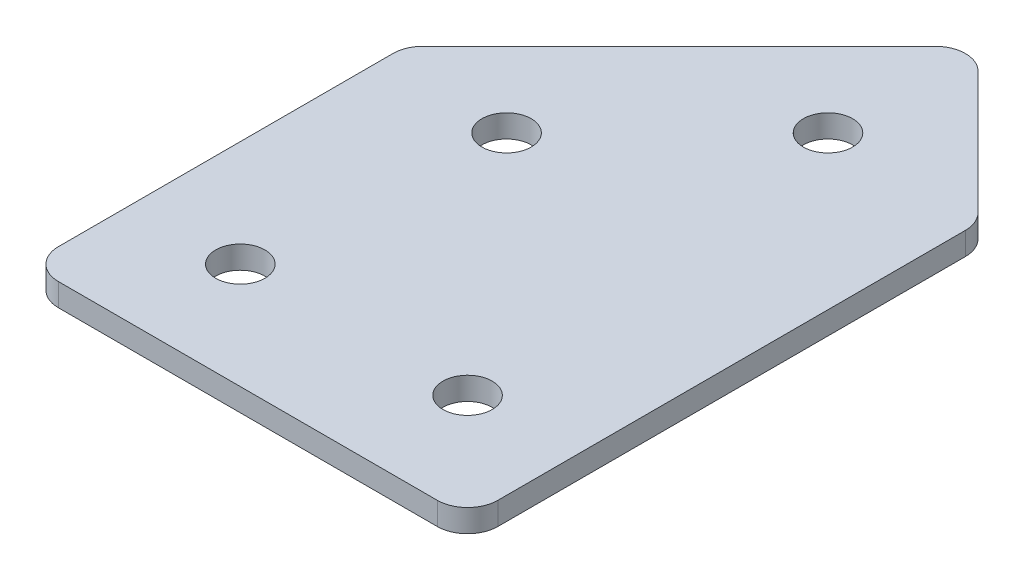
ISO-10303-21;
HEADER;
FILE_DESCRIPTION(('STEP AP214'),'2;1');
FILE_NAME('part.step','',(''),(''),'','','');
FILE_SCHEMA(('AUTOMOTIVE_DESIGN { 1 0 10303 214 1 1 1 1 }'));
ENDSEC;
DATA;
#1=APPLICATION_CONTEXT('core data for automotive mechanical design processes');
#2=APPLICATION_PROTOCOL_DEFINITION('international standard','automotive_design',2000,#1);
#3=PRODUCT_CONTEXT('',#1,'mechanical');
#4=PRODUCT('Part','Part','',(#3));
#5=PRODUCT_RELATED_PRODUCT_CATEGORY('part','',(#4));
#6=PRODUCT_DEFINITION_FORMATION('','',#4);
#7=PRODUCT_DEFINITION_CONTEXT('part definition',#1,'design');
#8=PRODUCT_DEFINITION('design','',#6,#7);
#9=PRODUCT_DEFINITION_SHAPE('','',#8);
#10=(LENGTH_UNIT() NAMED_UNIT(*) SI_UNIT(.MILLI.,.METRE.));
#11=(NAMED_UNIT(*) PLANE_ANGLE_UNIT() SI_UNIT($,.RADIAN.));
#12=(NAMED_UNIT(*) SI_UNIT($,.STERADIAN.) SOLID_ANGLE_UNIT());
#13=UNCERTAINTY_MEASURE_WITH_UNIT(LENGTH_MEASURE(1.E-05),#10,'distance_accuracy_value','');
#14=(GEOMETRIC_REPRESENTATION_CONTEXT(3) GLOBAL_UNCERTAINTY_ASSIGNED_CONTEXT((#13)) GLOBAL_UNIT_ASSIGNED_CONTEXT((#10,
#11,#12)) REPRESENTATION_CONTEXT('',''));
#15=CARTESIAN_POINT('',(0.,0.,0.));
#16=DIRECTION('',(0.,0.,1.));
#17=DIRECTION('',(1.,0.,0.));
#18=AXIS2_PLACEMENT_3D('',#15,#16,#17);
#19=CARTESIAN_POINT('',(-23.765908019154,1.95798729371791,13.040593860467));
#20=DIRECTION('',(0.,1.,0.));
#21=DIRECTION('',(0.,0.,1.));
#22=AXIS2_PLACEMENT_3D('',#19,#20,#21);
#23=PLANE('',#22);
#24=CARTESIAN_POINT('',(6.23409198085028,1.95798729371791,13.040593860467));
#25=DIRECTION('',(0.,1.,0.));
#26=DIRECTION('',(0.,0.,1.));
#27=AXIS2_PLACEMENT_3D('',#24,#25,#26);
#28=CIRCLE('',#27,1.62500000000001);
#29=CARTESIAN_POINT('',(6.23409198085028,1.95798729371791,14.6655938604671));
#30=VERTEX_POINT('',#29);
#31=EDGE_CURVE('E201',#30,#30,#28,.T.);
#32=ORIENTED_EDGE('',*,*,#31,.T.);
#33=EDGE_LOOP('',(#32));
#34=FACE_BOUND('',#33,.T.);
#35=CARTESIAN_POINT('',(3.1274902630521,1.95798729371791,-13.8528044217349));
#36=DIRECTION('',(0.,1.,0.));
#37=DIRECTION('',(0.,0.,1.));
#38=AXIS2_PLACEMENT_3D('',#35,#36,#37);
#39=CIRCLE('',#38,1.625);
#40=CARTESIAN_POINT('',(3.1274902630521,1.95798729371791,-12.2278044217349));
#41=VERTEX_POINT('',#40);
#42=EDGE_CURVE('E195',#41,#41,#39,.T.);
#43=ORIENTED_EDGE('',*,*,#42,.T.);
#44=EDGE_LOOP('',(#43));
#45=FACE_BOUND('',#44,.T.);
#46=CARTESIAN_POINT('',(-7.47911145474611,1.95798729371791,-3.24620270393665));
#47=DIRECTION('',(0.,1.,0.));
#48=DIRECTION('',(0.,0.,1.));
#49=AXIS2_PLACEMENT_3D('',#46,#47,#48);
#50=CIRCLE('',#49,1.625);
#51=CARTESIAN_POINT('',(-7.47911145474611,1.95798729371791,-1.62120270393664));
#52=VERTEX_POINT('',#51);
#53=EDGE_CURVE('E189',#52,#52,#50,.T.);
#54=ORIENTED_EDGE('',*,*,#53,.T.);
#55=EDGE_LOOP('',(#54));
#56=FACE_BOUND('',#55,.T.);
#57=CARTESIAN_POINT('',(-8.76590801914972,1.95798729371791,13.040593860467));
#58=DIRECTION('',(0.,1.,0.));
#59=DIRECTION('',(0.,0.,1.));
#60=AXIS2_PLACEMENT_3D('',#57,#58,#59);
#61=CIRCLE('',#60,1.625);
#62=CARTESIAN_POINT('',(-8.76590801914972,1.95798729371791,14.665593860467));
#63=VERTEX_POINT('',#62);
#64=EDGE_CURVE('E115',#63,#63,#61,.T.);
#65=ORIENTED_EDGE('',*,*,#64,.T.);
#66=EDGE_LOOP('',(#65));
#67=FACE_BOUND('',#66,.T.);
#68=DIRECTION('',(0.,0.,1.));
#69=VECTOR('',#68,1.);
#70=CARTESIAN_POINT('',(-15.7659080191497,1.95798729371791,-4.85890107614464));
#71=LINE('',#70,#69);
#72=CARTESIAN_POINT('',(-15.7659080191497,1.95798729371791,-4.03047395139844));
#73=VERTEX_POINT('',#72);
#74=CARTESIAN_POINT('',(-15.7659080191497,1.95798729371791,18.0405938604672));
#75=VERTEX_POINT('',#74);
#76=EDGE_CURVE('E182',#73,#75,#71,.T.);
#77=ORIENTED_EDGE('',*,*,#76,.F.);
#78=CARTESIAN_POINT('',(-13.7659080191497,1.95798729371791,-4.03047395139844));
#79=DIRECTION('',(0.,1.,0.));
#80=DIRECTION('',(0.,0.,1.));
#81=AXIS2_PLACEMENT_3D('',#78,#79,#80);
#82=CIRCLE('',#81,2.);
#83=CARTESIAN_POINT('',(-15.1801215815228,1.95798729371791,-5.44468751377155));
#84=VERTEX_POINT('',#83);
#85=EDGE_CURVE('E146',#73,#84,#82,.F.);
#86=ORIENTED_EDGE('',*,*,#85,.T.);
#87=DIRECTION('',(-0.707106781186547,0.,0.707106781186548));
#88=VECTOR('',#87,1.);
#89=CARTESIAN_POINT('',(3.12749026305218,1.95798729371791,-23.7522993583466));
#90=LINE('',#89,#88);
#91=CARTESIAN_POINT('',(1.71327670067908,1.95798729371791,-22.3380857959734));
#92=VERTEX_POINT('',#91);
#93=EDGE_CURVE('E174',#92,#84,#90,.T.);
#94=ORIENTED_EDGE('',*,*,#93,.F.);
#95=CARTESIAN_POINT('',(3.12749026305218,1.95798729371791,-20.9238722336003));
#96=DIRECTION('',(0.,1.,0.));
#97=DIRECTION('',(0.,0.,1.));
#98=AXIS2_PLACEMENT_3D('',#95,#96,#97);
#99=CIRCLE('',#98,2.);
#100=CARTESIAN_POINT('',(4.54170382542528,1.95798729371791,-22.3380857959734));
#101=VERTEX_POINT('',#100);
#102=EDGE_CURVE('E118',#92,#101,#99,.F.);
#103=ORIENTED_EDGE('',*,*,#102,.T.);
#104=DIRECTION('',(-0.707106781186544,0.,-0.707106781186551));
#105=VECTOR('',#104,1.);
#106=CARTESIAN_POINT('',(13.2340919808503,1.95798729371791,-13.6456976405483));
#107=LINE('',#106,#105);
#108=CARTESIAN_POINT('',(12.6483055432234,1.95798729371791,-14.2314840781753));
#109=VERTEX_POINT('',#108);
#110=EDGE_CURVE('E119',#109,#101,#107,.T.);
#111=ORIENTED_EDGE('',*,*,#110,.F.);
#112=CARTESIAN_POINT('',(11.2340919808503,1.95798729371791,-12.8172705158022));
#113=DIRECTION('',(0.,1.,0.));
#114=DIRECTION('',(0.,0.,1.));
#115=AXIS2_PLACEMENT_3D('',#112,#113,#114);
#116=CIRCLE('',#115,2.);
#117=CARTESIAN_POINT('',(13.2340919808503,1.95798729371791,-12.8172705158022));
#118=VERTEX_POINT('',#117);
#119=EDGE_CURVE('E141',#109,#118,#116,.F.);
#120=ORIENTED_EDGE('',*,*,#119,.T.);
#121=DIRECTION('',(0.,0.,-1.));
#122=VECTOR('',#121,1.);
#123=CARTESIAN_POINT('',(13.2340919808503,1.95798729371791,20.0405938604672));
#124=LINE('',#123,#122);
#125=CARTESIAN_POINT('',(13.2340919808503,1.95798729371791,18.0405938604672));
#126=VERTEX_POINT('',#125);
#127=EDGE_CURVE('E123',#126,#118,#124,.T.);
#128=ORIENTED_EDGE('',*,*,#127,.F.);
#129=CARTESIAN_POINT('',(11.2340919808503,1.95798729371791,18.0405938604672));
#130=DIRECTION('',(0.,1.,0.));
#131=DIRECTION('',(0.,0.,1.));
#132=AXIS2_PLACEMENT_3D('',#129,#130,#131);
#133=CIRCLE('',#132,2.);
#134=CARTESIAN_POINT('',(11.2340919808503,1.95798729371791,20.0405938604672));
#135=VERTEX_POINT('',#134);
#136=EDGE_CURVE('E31',#126,#135,#133,.F.);
#137=ORIENTED_EDGE('',*,*,#136,.T.);
#138=DIRECTION('',(1.,0.,0.));
#139=VECTOR('',#138,1.);
#140=CARTESIAN_POINT('',(-15.7659080191497,1.95798729371791,20.0405938604672));
#141=LINE('',#140,#139);
#142=CARTESIAN_POINT('',(-13.7659080191497,1.95798729371791,20.0405938604672));
#143=VERTEX_POINT('',#142);
#144=EDGE_CURVE('E180',#143,#135,#141,.T.);
#145=ORIENTED_EDGE('',*,*,#144,.F.);
#146=CARTESIAN_POINT('',(-13.7659080191497,1.95798729371791,18.0405938604672));
#147=DIRECTION('',(0.,1.,0.));
#148=DIRECTION('',(0.,0.,1.));
#149=AXIS2_PLACEMENT_3D('',#146,#147,#148);
#150=CIRCLE('',#149,2.);
#151=EDGE_CURVE('E144',#143,#75,#150,.F.);
#152=ORIENTED_EDGE('',*,*,#151,.T.);
#153=EDGE_LOOP('',(#77,#86,#94,#103,#111,#120,#128,#137,#145,#152));
#154=FACE_BOUND('',#153,.T.);
#155=ADVANCED_FACE('F16',(#34,#45,#56,#67,#154),#23,.F.);
#156=CARTESIAN_POINT('',(3.12749026305218,1.95798729371791,-23.7522993583466));
#157=DIRECTION('',(-0.707106781186548,0.,-0.707106781186547));
#158=DIRECTION('',(-0.707106781186547,0.,0.707106781186548));
#159=AXIS2_PLACEMENT_3D('',#156,#157,#158);
#160=PLANE('',#159);
#161=ORIENTED_EDGE('',*,*,#93,.T.);
#162=DIRECTION('',(0.,1.,0.));
#163=VECTOR('',#162,1.);
#164=CARTESIAN_POINT('',(-15.1801215815228,1.95798729371791,-5.44468751377154));
#165=LINE('',#164,#163);
#166=CARTESIAN_POINT('',(-15.1801215815228,3.45798729371791,-5.44468751377155));
#167=VERTEX_POINT('',#166);
#168=EDGE_CURVE('E105',#84,#167,#165,.T.);
#169=ORIENTED_EDGE('',*,*,#168,.T.);
#170=DIRECTION('',(-0.707106781186547,0.,0.707106781186548));
#171=VECTOR('',#170,1.);
#172=CARTESIAN_POINT('',(3.12749026305218,3.45798729371791,-23.7522993583466));
#173=LINE('',#172,#171);
#174=CARTESIAN_POINT('',(1.71327670067908,3.45798729371791,-22.3380857959734));
#175=VERTEX_POINT('',#174);
#176=EDGE_CURVE('E97',#175,#167,#173,.T.);
#177=ORIENTED_EDGE('',*,*,#176,.F.);
#178=DIRECTION('',(0.,1.,0.));
#179=VECTOR('',#178,1.);
#180=CARTESIAN_POINT('',(1.71327670067908,1.95798729371791,-22.3380857959734));
#181=LINE('',#180,#179);
#182=EDGE_CURVE('E111',#175,#92,#181,.F.);
#183=ORIENTED_EDGE('',*,*,#182,.T.);
#184=EDGE_LOOP('',(#161,#169,#177,#183));
#185=FACE_BOUND('',#184,.T.);
#186=ADVANCED_FACE('F110',(#185),#160,.T.);
#187=CARTESIAN_POINT('',(13.2340919808503,1.95798729371791,-13.6456976405483));
#188=DIRECTION('',(0.707106781186551,0.,-0.707106781186544));
#189=DIRECTION('',(-0.707106781186544,0.,-0.707106781186551));
#190=AXIS2_PLACEMENT_3D('',#187,#188,#189);
#191=PLANE('',#190);
#192=DIRECTION('',(-0.707106781186544,0.,-0.707106781186551));
#193=VECTOR('',#192,1.);
#194=CARTESIAN_POINT('',(13.2340919808503,3.45798729371791,-13.6456976405483));
#195=LINE('',#194,#193);
#196=CARTESIAN_POINT('',(12.6483055432234,3.45798729371791,-14.2314840781753));
#197=VERTEX_POINT('',#196);
#198=CARTESIAN_POINT('',(4.54170382542528,3.45798729371791,-22.3380857959734));
#199=VERTEX_POINT('',#198);
#200=EDGE_CURVE('E99',#197,#199,#195,.T.);
#201=ORIENTED_EDGE('',*,*,#200,.F.);
#202=DIRECTION('',(0.,1.,0.));
#203=VECTOR('',#202,1.);
#204=CARTESIAN_POINT('',(12.6483055432234,1.95798729371791,-14.2314840781753));
#205=LINE('',#204,#203);
#206=EDGE_CURVE('E10',#197,#109,#205,.F.);
#207=ORIENTED_EDGE('',*,*,#206,.T.);
#208=ORIENTED_EDGE('',*,*,#110,.T.);
#209=DIRECTION('',(0.,1.,0.));
#210=VECTOR('',#209,1.);
#211=CARTESIAN_POINT('',(4.54170382542528,1.95798729371791,-22.3380857959734));
#212=LINE('',#211,#210);
#213=EDGE_CURVE('E24',#101,#199,#212,.T.);
#214=ORIENTED_EDGE('',*,*,#213,.T.);
#215=EDGE_LOOP('',(#201,#207,#208,#214));
#216=FACE_BOUND('',#215,.T.);
#217=ADVANCED_FACE('F157',(#216),#191,.T.);
#218=CARTESIAN_POINT('',(13.2340919808503,1.95798729371791,20.0405938604672));
#219=DIRECTION('',(1.,0.,0.));
#220=DIRECTION('',(0.,0.,-1.));
#221=AXIS2_PLACEMENT_3D('',#218,#219,#220);
#222=PLANE('',#221);
#223=DIRECTION('',(0.,0.,-1.));
#224=VECTOR('',#223,1.);
#225=CARTESIAN_POINT('',(13.2340919808503,3.45798729371791,20.0405938604672));
#226=LINE('',#225,#224);
#227=CARTESIAN_POINT('',(13.2340919808503,3.45798729371791,18.0405938604672));
#228=VERTEX_POINT('',#227);
#229=CARTESIAN_POINT('',(13.2340919808503,3.45798729371791,-12.8172705158022));
#230=VERTEX_POINT('',#229);
#231=EDGE_CURVE('E170',#228,#230,#226,.T.);
#232=ORIENTED_EDGE('',*,*,#231,.F.);
#233=DIRECTION('',(0.,1.,0.));
#234=VECTOR('',#233,1.);
#235=CARTESIAN_POINT('',(13.2340919808503,1.95798729371791,18.0405938604672));
#236=LINE('',#235,#234);
#237=EDGE_CURVE('E155',#228,#126,#236,.F.);
#238=ORIENTED_EDGE('',*,*,#237,.T.);
#239=ORIENTED_EDGE('',*,*,#127,.T.);
#240=DIRECTION('',(0.,1.,0.));
#241=VECTOR('',#240,1.);
#242=CARTESIAN_POINT('',(13.2340919808503,1.95798729371791,-12.8172705158022));
#243=LINE('',#242,#241);
#244=EDGE_CURVE('E152',#118,#230,#243,.T.);
#245=ORIENTED_EDGE('',*,*,#244,.T.);
#246=EDGE_LOOP('',(#232,#238,#239,#245));
#247=FACE_BOUND('',#246,.T.);
#248=ADVANCED_FACE('F169',(#247),#222,.T.);
#249=CARTESIAN_POINT('',(-15.7659080191497,1.95798729371791,20.0405938604672));
#250=DIRECTION('',(0.,0.,1.));
#251=DIRECTION('',(1.,0.,0.));
#252=AXIS2_PLACEMENT_3D('',#249,#250,#251);
#253=PLANE('',#252);
#254=DIRECTION('',(1.,0.,0.));
#255=VECTOR('',#254,1.);
#256=CARTESIAN_POINT('',(-15.7659080191497,3.45798729371791,20.0405938604672));
#257=LINE('',#256,#255);
#258=CARTESIAN_POINT('',(-13.7659080191497,3.45798729371791,20.0405938604672));
#259=VERTEX_POINT('',#258);
#260=CARTESIAN_POINT('',(11.2340919808503,3.45798729371791,20.0405938604672));
#261=VERTEX_POINT('',#260);
#262=EDGE_CURVE('E173',#259,#261,#257,.T.);
#263=ORIENTED_EDGE('',*,*,#262,.F.);
#264=DIRECTION('',(0.,1.,0.));
#265=VECTOR('',#264,1.);
#266=CARTESIAN_POINT('',(-13.7659080191497,1.95798729371791,20.0405938604672));
#267=LINE('',#266,#265);
#268=EDGE_CURVE('E38',#259,#143,#267,.F.);
#269=ORIENTED_EDGE('',*,*,#268,.T.);
#270=ORIENTED_EDGE('',*,*,#144,.T.);
#271=DIRECTION('',(0.,1.,0.));
#272=VECTOR('',#271,1.);
#273=CARTESIAN_POINT('',(11.2340919808503,1.95798729371791,20.0405938604672));
#274=LINE('',#273,#272);
#275=EDGE_CURVE('E148',#135,#261,#274,.T.);
#276=ORIENTED_EDGE('',*,*,#275,.T.);
#277=EDGE_LOOP('',(#263,#269,#270,#276));
#278=FACE_BOUND('',#277,.T.);
#279=ADVANCED_FACE('F333',(#278),#253,.T.);
#280=CARTESIAN_POINT('',(-15.7659080191497,1.95798729371791,-4.85890107614464));
#281=DIRECTION('',(-1.,0.,0.));
#282=DIRECTION('',(0.,0.,1.));
#283=AXIS2_PLACEMENT_3D('',#280,#281,#282);
#284=PLANE('',#283);
#285=DIRECTION('',(0.,0.,1.));
#286=VECTOR('',#285,1.);
#287=CARTESIAN_POINT('',(-15.7659080191497,3.45798729371791,-4.85890107614464));
#288=LINE('',#287,#286);
#289=CARTESIAN_POINT('',(-15.7659080191497,3.45798729371791,-4.03047395139844));
#290=VERTEX_POINT('',#289);
#291=CARTESIAN_POINT('',(-15.7659080191497,3.45798729371791,18.0405938604672));
#292=VERTEX_POINT('',#291);
#293=EDGE_CURVE('E114',#290,#292,#288,.T.);
#294=ORIENTED_EDGE('',*,*,#293,.F.);
#295=DIRECTION('',(0.,1.,0.));
#296=VECTOR('',#295,1.);
#297=CARTESIAN_POINT('',(-15.7659080191497,1.95798729371791,-4.03047395139844));
#298=LINE('',#297,#296);
#299=EDGE_CURVE('E138',#290,#73,#298,.F.);
#300=ORIENTED_EDGE('',*,*,#299,.T.);
#301=ORIENTED_EDGE('',*,*,#76,.T.);
#302=DIRECTION('',(0.,1.,0.));
#303=VECTOR('',#302,1.);
#304=CARTESIAN_POINT('',(-15.7659080191497,1.95798729371791,18.0405938604672));
#305=LINE('',#304,#303);
#306=EDGE_CURVE('E135',#75,#292,#305,.T.);
#307=ORIENTED_EDGE('',*,*,#306,.T.);
#308=EDGE_LOOP('',(#294,#300,#301,#307));
#309=FACE_BOUND('',#308,.T.);
#310=ADVANCED_FACE('F223',(#309),#284,.T.);
#311=CARTESIAN_POINT('',(-23.765908019154,3.45798729371791,13.040593860467));
#312=DIRECTION('',(0.,1.,0.));
#313=DIRECTION('',(0.,0.,1.));
#314=AXIS2_PLACEMENT_3D('',#311,#312,#313);
#315=PLANE('',#314);
#316=CARTESIAN_POINT('',(6.23409198085028,3.45798729371791,13.040593860467));
#317=DIRECTION('',(0.,1.,0.));
#318=DIRECTION('',(0.,0.,1.));
#319=AXIS2_PLACEMENT_3D('',#316,#317,#318);
#320=CIRCLE('',#319,1.62500000000001);
#321=CARTESIAN_POINT('',(6.23409198085028,3.45798729371791,14.6655938604671));
#322=VERTEX_POINT('',#321);
#323=EDGE_CURVE('E204',#322,#322,#320,.T.);
#324=ORIENTED_EDGE('',*,*,#323,.F.);
#325=EDGE_LOOP('',(#324));
#326=FACE_BOUND('',#325,.T.);
#327=CARTESIAN_POINT('',(3.1274902630521,3.45798729371791,-13.8528044217349));
#328=DIRECTION('',(0.,1.,0.));
#329=DIRECTION('',(0.,0.,1.));
#330=AXIS2_PLACEMENT_3D('',#327,#328,#329);
#331=CIRCLE('',#330,1.625);
#332=CARTESIAN_POINT('',(3.1274902630521,3.45798729371791,-12.2278044217349));
#333=VERTEX_POINT('',#332);
#334=EDGE_CURVE('E198',#333,#333,#331,.T.);
#335=ORIENTED_EDGE('',*,*,#334,.F.);
#336=EDGE_LOOP('',(#335));
#337=FACE_BOUND('',#336,.T.);
#338=CARTESIAN_POINT('',(-7.47911145474611,3.45798729371791,-3.24620270393665));
#339=DIRECTION('',(0.,1.,0.));
#340=DIRECTION('',(0.,0.,1.));
#341=AXIS2_PLACEMENT_3D('',#338,#339,#340);
#342=CIRCLE('',#341,1.625);
#343=CARTESIAN_POINT('',(-7.47911145474611,3.45798729371791,-1.62120270393664));
#344=VERTEX_POINT('',#343);
#345=EDGE_CURVE('E192',#344,#344,#342,.T.);
#346=ORIENTED_EDGE('',*,*,#345,.F.);
#347=EDGE_LOOP('',(#346));
#348=FACE_BOUND('',#347,.T.);
#349=CARTESIAN_POINT('',(-8.76590801914972,3.45798729371791,13.040593860467));
#350=DIRECTION('',(0.,1.,0.));
#351=DIRECTION('',(0.,0.,1.));
#352=AXIS2_PLACEMENT_3D('',#349,#350,#351);
#353=CIRCLE('',#352,1.625);
#354=CARTESIAN_POINT('',(-8.76590801914972,3.45798729371791,14.665593860467));
#355=VERTEX_POINT('',#354);
#356=EDGE_CURVE('E186',#355,#355,#353,.T.);
#357=ORIENTED_EDGE('',*,*,#356,.F.);
#358=EDGE_LOOP('',(#357));
#359=FACE_BOUND('',#358,.T.);
#360=ORIENTED_EDGE('',*,*,#176,.T.);
#361=CARTESIAN_POINT('',(-13.7659080191497,3.45798729371791,-4.03047395139844));
#362=DIRECTION('',(0.,1.,0.));
#363=DIRECTION('',(0.,0.,1.));
#364=AXIS2_PLACEMENT_3D('',#361,#362,#363);
#365=CIRCLE('',#364,2.);
#366=EDGE_CURVE('E133',#167,#290,#365,.T.);
#367=ORIENTED_EDGE('',*,*,#366,.T.);
#368=ORIENTED_EDGE('',*,*,#293,.T.);
#369=CARTESIAN_POINT('',(-13.7659080191497,3.45798729371791,18.0405938604672));
#370=DIRECTION('',(0.,1.,0.));
#371=DIRECTION('',(0.,0.,1.));
#372=AXIS2_PLACEMENT_3D('',#369,#370,#371);
#373=CIRCLE('',#372,2.);
#374=EDGE_CURVE('E131',#292,#259,#373,.T.);
#375=ORIENTED_EDGE('',*,*,#374,.T.);
#376=ORIENTED_EDGE('',*,*,#262,.T.);
#377=CARTESIAN_POINT('',(11.2340919808503,3.45798729371791,18.0405938604672));
#378=DIRECTION('',(0.,1.,0.));
#379=DIRECTION('',(0.,0.,1.));
#380=AXIS2_PLACEMENT_3D('',#377,#378,#379);
#381=CIRCLE('',#380,2.);
#382=EDGE_CURVE('E129',#261,#228,#381,.T.);
#383=ORIENTED_EDGE('',*,*,#382,.T.);
#384=ORIENTED_EDGE('',*,*,#231,.T.);
#385=CARTESIAN_POINT('',(11.2340919808503,3.45798729371791,-12.8172705158022));
#386=DIRECTION('',(0.,1.,0.));
#387=DIRECTION('',(0.,0.,1.));
#388=AXIS2_PLACEMENT_3D('',#385,#386,#387);
#389=CIRCLE('',#388,2.);
#390=EDGE_CURVE('E104',#230,#197,#389,.T.);
#391=ORIENTED_EDGE('',*,*,#390,.T.);
#392=ORIENTED_EDGE('',*,*,#200,.T.);
#393=CARTESIAN_POINT('',(3.12749026305218,3.45798729371791,-20.9238722336003));
#394=DIRECTION('',(0.,1.,0.));
#395=DIRECTION('',(0.,0.,1.));
#396=AXIS2_PLACEMENT_3D('',#393,#394,#395);
#397=CIRCLE('',#396,2.);
#398=EDGE_CURVE('E94',#199,#175,#397,.T.);
#399=ORIENTED_EDGE('',*,*,#398,.T.);
#400=EDGE_LOOP('',(#360,#367,#368,#375,#376,#383,#384,#391,#392,#399));
#401=FACE_BOUND('',#400,.T.);
#402=ADVANCED_FACE('F96',(#326,#337,#348,#359,#401),#315,.T.);
#403=CARTESIAN_POINT('',(-8.76590801914972,1.95798729371791,13.040593860467));
#404=DIRECTION('',(0.,1.,0.));
#405=DIRECTION('',(0.,0.,1.));
#406=AXIS2_PLACEMENT_3D('',#403,#404,#405);
#407=CYLINDRICAL_SURFACE('',#406,1.625);
#408=ORIENTED_EDGE('',*,*,#64,.F.);
#409=EDGE_LOOP('',(#408));
#410=FACE_BOUND('',#409,.T.);
#411=ORIENTED_EDGE('',*,*,#356,.T.);
#412=EDGE_LOOP('',(#411));
#413=FACE_BOUND('',#412,.T.);
#414=ADVANCED_FACE('F222',(#410,#413),#407,.F.);
#415=CARTESIAN_POINT('',(-7.47911145474611,1.95798729371791,-3.24620270393665));
#416=DIRECTION('',(0.,1.,0.));
#417=DIRECTION('',(0.,0.,1.));
#418=AXIS2_PLACEMENT_3D('',#415,#416,#417);
#419=CYLINDRICAL_SURFACE('',#418,1.625);
#420=ORIENTED_EDGE('',*,*,#53,.F.);
#421=EDGE_LOOP('',(#420));
#422=FACE_BOUND('',#421,.T.);
#423=ORIENTED_EDGE('',*,*,#345,.T.);
#424=EDGE_LOOP('',(#423));
#425=FACE_BOUND('',#424,.T.);
#426=ADVANCED_FACE('F232',(#422,#425),#419,.F.);
#427=CARTESIAN_POINT('',(3.1274902630521,1.95798729371791,-13.8528044217349));
#428=DIRECTION('',(0.,1.,0.));
#429=DIRECTION('',(0.,0.,1.));
#430=AXIS2_PLACEMENT_3D('',#427,#428,#429);
#431=CYLINDRICAL_SURFACE('',#430,1.625);
#432=ORIENTED_EDGE('',*,*,#42,.F.);
#433=EDGE_LOOP('',(#432));
#434=FACE_BOUND('',#433,.T.);
#435=ORIENTED_EDGE('',*,*,#334,.T.);
#436=EDGE_LOOP('',(#435));
#437=FACE_BOUND('',#436,.T.);
#438=ADVANCED_FACE('F216',(#434,#437),#431,.F.);
#439=CARTESIAN_POINT('',(6.23409198085028,1.95798729371791,13.040593860467));
#440=DIRECTION('',(0.,1.,0.));
#441=DIRECTION('',(0.,0.,1.));
#442=AXIS2_PLACEMENT_3D('',#439,#440,#441);
#443=CYLINDRICAL_SURFACE('',#442,1.62500000000001);
#444=ORIENTED_EDGE('',*,*,#31,.F.);
#445=EDGE_LOOP('',(#444));
#446=FACE_BOUND('',#445,.T.);
#447=ORIENTED_EDGE('',*,*,#323,.T.);
#448=EDGE_LOOP('',(#447));
#449=FACE_BOUND('',#448,.T.);
#450=ADVANCED_FACE('F212',(#446,#449),#443,.F.);
#451=CARTESIAN_POINT('',(-13.7659080191497,1.95798729371791,-4.03047395139844));
#452=DIRECTION('',(0.,1.,0.));
#453=DIRECTION('',(0.,0.,1.));
#454=AXIS2_PLACEMENT_3D('',#451,#452,#453);
#455=CYLINDRICAL_SURFACE('',#454,2.);
#456=ORIENTED_EDGE('',*,*,#85,.F.);
#457=ORIENTED_EDGE('',*,*,#299,.F.);
#458=ORIENTED_EDGE('',*,*,#366,.F.);
#459=ORIENTED_EDGE('',*,*,#168,.F.);
#460=EDGE_LOOP('',(#456,#457,#458,#459));
#461=FACE_BOUND('',#460,.T.);
#462=ADVANCED_FACE('F215',(#461),#455,.T.);
#463=CARTESIAN_POINT('',(-13.7659080191497,1.95798729371791,18.0405938604672));
#464=DIRECTION('',(0.,1.,0.));
#465=DIRECTION('',(0.,0.,1.));
#466=AXIS2_PLACEMENT_3D('',#463,#464,#465);
#467=CYLINDRICAL_SURFACE('',#466,2.);
#468=ORIENTED_EDGE('',*,*,#151,.F.);
#469=ORIENTED_EDGE('',*,*,#268,.F.);
#470=ORIENTED_EDGE('',*,*,#374,.F.);
#471=ORIENTED_EDGE('',*,*,#306,.F.);
#472=EDGE_LOOP('',(#468,#469,#470,#471));
#473=FACE_BOUND('',#472,.T.);
#474=ADVANCED_FACE('F252',(#473),#467,.T.);
#475=CARTESIAN_POINT('',(11.2340919808503,1.95798729371791,18.0405938604672));
#476=DIRECTION('',(0.,1.,0.));
#477=DIRECTION('',(0.,0.,1.));
#478=AXIS2_PLACEMENT_3D('',#475,#476,#477);
#479=CYLINDRICAL_SURFACE('',#478,2.);
#480=ORIENTED_EDGE('',*,*,#136,.F.);
#481=ORIENTED_EDGE('',*,*,#237,.F.);
#482=ORIENTED_EDGE('',*,*,#382,.F.);
#483=ORIENTED_EDGE('',*,*,#275,.F.);
#484=EDGE_LOOP('',(#480,#481,#482,#483));
#485=FACE_BOUND('',#484,.T.);
#486=ADVANCED_FACE('F256',(#485),#479,.T.);
#487=CARTESIAN_POINT('',(11.2340919808503,1.95798729371791,-12.8172705158022));
#488=DIRECTION('',(0.,1.,0.));
#489=DIRECTION('',(0.,0.,1.));
#490=AXIS2_PLACEMENT_3D('',#487,#488,#489);
#491=CYLINDRICAL_SURFACE('',#490,2.);
#492=ORIENTED_EDGE('',*,*,#119,.F.);
#493=ORIENTED_EDGE('',*,*,#206,.F.);
#494=ORIENTED_EDGE('',*,*,#390,.F.);
#495=ORIENTED_EDGE('',*,*,#244,.F.);
#496=EDGE_LOOP('',(#492,#493,#494,#495));
#497=FACE_BOUND('',#496,.T.);
#498=ADVANCED_FACE('F165',(#497),#491,.T.);
#499=CARTESIAN_POINT('',(3.12749026305218,1.95798729371791,-20.9238722336003));
#500=DIRECTION('',(0.,1.,0.));
#501=DIRECTION('',(0.,0.,1.));
#502=AXIS2_PLACEMENT_3D('',#499,#500,#501);
#503=CYLINDRICAL_SURFACE('',#502,2.);
#504=ORIENTED_EDGE('',*,*,#102,.F.);
#505=ORIENTED_EDGE('',*,*,#182,.F.);
#506=ORIENTED_EDGE('',*,*,#398,.F.);
#507=ORIENTED_EDGE('',*,*,#213,.F.);
#508=EDGE_LOOP('',(#504,#505,#506,#507));
#509=FACE_BOUND('',#508,.T.);
#510=ADVANCED_FACE('F18',(#509),#503,.T.);
#511=CLOSED_SHELL('',(#155,#186,#217,#248,#279,#310,#402,#414,#426,#438,#450,#462,#474,#486,
#498,#510));
#512=MANIFOLD_SOLID_BREP('B1',#511);
#513=ADVANCED_BREP_SHAPE_REPRESENTATION('',(#18,#512),#14);
#514=SHAPE_DEFINITION_REPRESENTATION(#9,#513);
ENDSEC;
END-ISO-10303-21;
